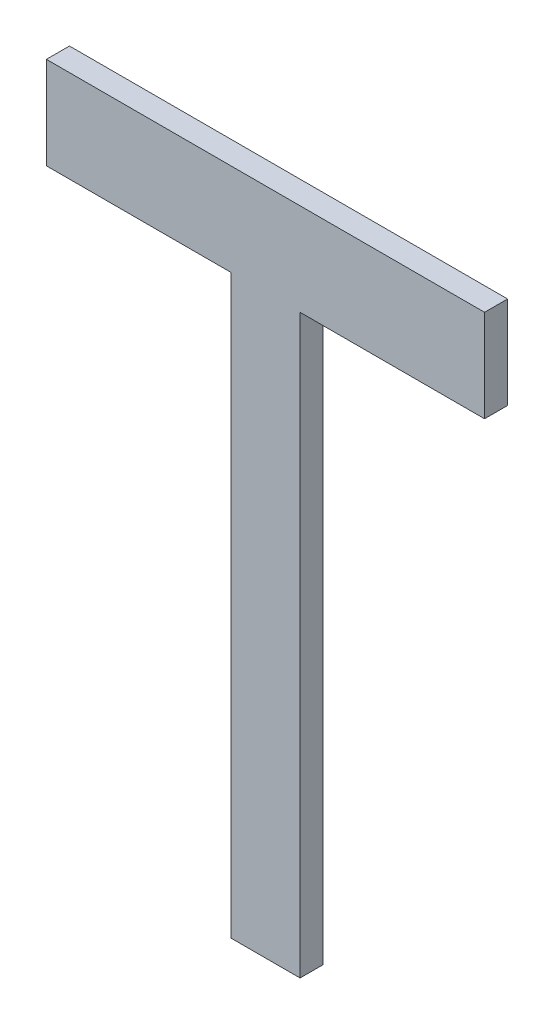
ISO-10303-21;
HEADER;
FILE_DESCRIPTION(('STEP AP214'),'2;1');
FILE_NAME('part.step','',(''),(''),'','','');
FILE_SCHEMA(('AUTOMOTIVE_DESIGN { 1 0 10303 214 1 1 1 1 }'));
ENDSEC;
DATA;
#1=APPLICATION_CONTEXT('core data for automotive mechanical design processes');
#2=APPLICATION_PROTOCOL_DEFINITION('international standard','automotive_design',2000,#1);
#3=PRODUCT_CONTEXT('',#1,'mechanical');
#4=PRODUCT('Part','Part','',(#3));
#5=PRODUCT_RELATED_PRODUCT_CATEGORY('part','',(#4));
#6=PRODUCT_DEFINITION_FORMATION('','',#4);
#7=PRODUCT_DEFINITION_CONTEXT('part definition',#1,'design');
#8=PRODUCT_DEFINITION('design','',#6,#7);
#9=PRODUCT_DEFINITION_SHAPE('','',#8);
#10=(LENGTH_UNIT() NAMED_UNIT(*) SI_UNIT(.MILLI.,.METRE.));
#11=(NAMED_UNIT(*) PLANE_ANGLE_UNIT() SI_UNIT($,.RADIAN.));
#12=(NAMED_UNIT(*) SI_UNIT($,.STERADIAN.) SOLID_ANGLE_UNIT());
#13=UNCERTAINTY_MEASURE_WITH_UNIT(LENGTH_MEASURE(1.E-05),#10,'distance_accuracy_value','');
#14=(GEOMETRIC_REPRESENTATION_CONTEXT(3) GLOBAL_UNCERTAINTY_ASSIGNED_CONTEXT((#13)) GLOBAL_UNIT_ASSIGNED_CONTEXT((#10,
#11,#12)) REPRESENTATION_CONTEXT('',''));
#15=CARTESIAN_POINT('',(0.,0.,0.));
#16=DIRECTION('',(0.,0.,1.));
#17=DIRECTION('',(1.,0.,0.));
#18=AXIS2_PLACEMENT_3D('',#15,#16,#17);
#19=CARTESIAN_POINT('',(-0.09499854000001,0.14500098,0.01));
#20=DIRECTION('',(0.,0.,-1.));
#21=DIRECTION('',(-1.,0.,0.));
#22=AXIS2_PLACEMENT_3D('',#19,#20,#21);
#23=PLANE('',#22);
#24=DIRECTION('',(1.,0.,0.));
#25=VECTOR('',#24,1.);
#26=CARTESIAN_POINT('',(-0.09499854000001,0.10500106,0.01));
#27=LINE('',#26,#25);
#28=CARTESIAN_POINT('',(-0.09499854000001,0.10500106,0.01));
#29=VERTEX_POINT('',#28);
#30=CARTESIAN_POINT('',(-0.01499870000001,0.10500106,0.01));
#31=VERTEX_POINT('',#30);
#32=EDGE_CURVE('E115',#29,#31,#27,.T.);
#33=ORIENTED_EDGE('',*,*,#32,.T.);
#34=DIRECTION('',(0.,1.,0.));
#35=VECTOR('',#34,1.);
#36=CARTESIAN_POINT('',(-0.01499870000001,0.10500106,0.01));
#37=LINE('',#36,#35);
#38=CARTESIAN_POINT('',(-0.01499870000001,-0.14499844,0.01));
#39=VERTEX_POINT('',#38);
#40=EDGE_CURVE('E111',#31,#39,#37,.F.);
#41=ORIENTED_EDGE('',*,*,#40,.T.);
#42=DIRECTION('',(1.,0.,0.));
#43=VECTOR('',#42,1.);
#44=CARTESIAN_POINT('',(-0.01499870000001,-0.14499844,0.01));
#45=LINE('',#44,#43);
#46=CARTESIAN_POINT('',(0.01500124,-0.14499844,0.01));
#47=VERTEX_POINT('',#46);
#48=EDGE_CURVE('E107',#39,#47,#45,.T.);
#49=ORIENTED_EDGE('',*,*,#48,.T.);
#50=DIRECTION('',(0.,1.,0.));
#51=VECTOR('',#50,1.);
#52=CARTESIAN_POINT('',(0.01500124,-0.14499844,0.01));
#53=LINE('',#52,#51);
#54=CARTESIAN_POINT('',(0.01500124,0.10500106,0.01));
#55=VERTEX_POINT('',#54);
#56=EDGE_CURVE('E103',#47,#55,#53,.T.);
#57=ORIENTED_EDGE('',*,*,#56,.T.);
#58=DIRECTION('',(1.,0.,0.));
#59=VECTOR('',#58,1.);
#60=CARTESIAN_POINT('',(0.01500124,0.10500106,0.01));
#61=LINE('',#60,#59);
#62=CARTESIAN_POINT('',(0.09500108,0.10500106,0.01));
#63=VERTEX_POINT('',#62);
#64=EDGE_CURVE('E79',#55,#63,#61,.T.);
#65=ORIENTED_EDGE('',*,*,#64,.T.);
#66=DIRECTION('',(0.,1.,0.));
#67=VECTOR('',#66,1.);
#68=CARTESIAN_POINT('',(0.09500108,0.10500106,0.01));
#69=LINE('',#68,#67);
#70=CARTESIAN_POINT('',(0.09500108,0.14500098,0.01));
#71=VERTEX_POINT('',#70);
#72=EDGE_CURVE('E81',#63,#71,#69,.T.);
#73=ORIENTED_EDGE('',*,*,#72,.T.);
#74=DIRECTION('',(1.,0.,0.));
#75=VECTOR('',#74,1.);
#76=CARTESIAN_POINT('',(0.09500108,0.14500098,0.01));
#77=LINE('',#76,#75);
#78=CARTESIAN_POINT('',(-0.09499854000001,0.14500098,0.01));
#79=VERTEX_POINT('',#78);
#80=EDGE_CURVE('E19',#71,#79,#77,.F.);
#81=ORIENTED_EDGE('',*,*,#80,.T.);
#82=DIRECTION('',(0.,1.,0.));
#83=VECTOR('',#82,1.);
#84=CARTESIAN_POINT('',(-0.09499854000001,0.14500098,0.01));
#85=LINE('',#84,#83);
#86=EDGE_CURVE('E120',#79,#29,#85,.F.);
#87=ORIENTED_EDGE('',*,*,#86,.T.);
#88=EDGE_LOOP('',(#33,#41,#49,#57,#65,#73,#81,#87));
#89=FACE_BOUND('',#88,.T.);
#90=ADVANCED_FACE('F16',(#89),#23,.F.);
#91=CARTESIAN_POINT('',(0.09500108,0.14500098,0.));
#92=DIRECTION('',(0.,-1.,0.));
#93=DIRECTION('',(0.,0.,-1.));
#94=AXIS2_PLACEMENT_3D('',#91,#92,#93);
#95=PLANE('',#94);
#96=DIRECTION('',(0.,0.,-1.));
#97=VECTOR('',#96,1.);
#98=CARTESIAN_POINT('',(-0.09499854000001,0.14500098,0.));
#99=LINE('',#98,#97);
#100=CARTESIAN_POINT('',(-0.09499854000001,0.14500098,0.));
#101=VERTEX_POINT('',#100);
#102=EDGE_CURVE('E92',#101,#79,#99,.F.);
#103=ORIENTED_EDGE('',*,*,#102,.T.);
#104=ORIENTED_EDGE('',*,*,#80,.F.);
#105=DIRECTION('',(0.,0.,1.));
#106=VECTOR('',#105,1.);
#107=CARTESIAN_POINT('',(0.09500108,0.14500098,0.));
#108=LINE('',#107,#106);
#109=CARTESIAN_POINT('',(0.09500108,0.14500098,0.));
#110=VERTEX_POINT('',#109);
#111=EDGE_CURVE('E87',#71,#110,#108,.F.);
#112=ORIENTED_EDGE('',*,*,#111,.T.);
#113=DIRECTION('',(-1.,0.,0.));
#114=VECTOR('',#113,1.);
#115=CARTESIAN_POINT('',(-0.09499854000001,0.14500098,0.));
#116=LINE('',#115,#114);
#117=EDGE_CURVE('E123',#101,#110,#116,.F.);
#118=ORIENTED_EDGE('',*,*,#117,.F.);
#119=EDGE_LOOP('',(#103,#104,#112,#118));
#120=FACE_BOUND('',#119,.T.);
#121=ADVANCED_FACE('F89',(#120),#95,.F.);
#122=CARTESIAN_POINT('',(0.09500108,0.10500106,0.));
#123=DIRECTION('',(-1.,0.,0.));
#124=DIRECTION('',(0.,0.,1.));
#125=AXIS2_PLACEMENT_3D('',#122,#123,#124);
#126=PLANE('',#125);
#127=ORIENTED_EDGE('',*,*,#111,.F.);
#128=ORIENTED_EDGE('',*,*,#72,.F.);
#129=DIRECTION('',(0.,0.,1.));
#130=VECTOR('',#129,1.);
#131=CARTESIAN_POINT('',(0.09500108,0.10500106,0.));
#132=LINE('',#131,#130);
#133=CARTESIAN_POINT('',(0.09500108,0.10500106,0.));
#134=VERTEX_POINT('',#133);
#135=EDGE_CURVE('E99',#63,#134,#132,.F.);
#136=ORIENTED_EDGE('',*,*,#135,.T.);
#137=DIRECTION('',(0.,1.,0.));
#138=VECTOR('',#137,1.);
#139=CARTESIAN_POINT('',(0.09500108,0.14500098,0.));
#140=LINE('',#139,#138);
#141=EDGE_CURVE('E96',#110,#134,#140,.F.);
#142=ORIENTED_EDGE('',*,*,#141,.F.);
#143=EDGE_LOOP('',(#127,#128,#136,#142));
#144=FACE_BOUND('',#143,.T.);
#145=ADVANCED_FACE('F94',(#144),#126,.F.);
#146=CARTESIAN_POINT('',(0.01500124,0.10500106,0.));
#147=DIRECTION('',(0.,1.,0.));
#148=DIRECTION('',(0.,0.,1.));
#149=AXIS2_PLACEMENT_3D('',#146,#147,#148);
#150=PLANE('',#149);
#151=ORIENTED_EDGE('',*,*,#135,.F.);
#152=ORIENTED_EDGE('',*,*,#64,.F.);
#153=DIRECTION('',(0.,0.,1.));
#154=VECTOR('',#153,1.);
#155=CARTESIAN_POINT('',(0.01500124,0.10500106,0.));
#156=LINE('',#155,#154);
#157=CARTESIAN_POINT('',(0.01500124,0.10500106,0.));
#158=VERTEX_POINT('',#157);
#159=EDGE_CURVE('E105',#55,#158,#156,.F.);
#160=ORIENTED_EDGE('',*,*,#159,.T.);
#161=DIRECTION('',(-1.,0.,0.));
#162=VECTOR('',#161,1.);
#163=CARTESIAN_POINT('',(-0.09499854000001,0.10500106,0.));
#164=LINE('',#163,#162);
#165=EDGE_CURVE('E126',#134,#158,#164,.T.);
#166=ORIENTED_EDGE('',*,*,#165,.F.);
#167=EDGE_LOOP('',(#151,#152,#160,#166));
#168=FACE_BOUND('',#167,.T.);
#169=ADVANCED_FACE('F159',(#168),#150,.F.);
#170=CARTESIAN_POINT('',(0.01500124,-0.14499844,0.));
#171=DIRECTION('',(-1.,0.,0.));
#172=DIRECTION('',(0.,0.,1.));
#173=AXIS2_PLACEMENT_3D('',#170,#171,#172);
#174=PLANE('',#173);
#175=ORIENTED_EDGE('',*,*,#159,.F.);
#176=ORIENTED_EDGE('',*,*,#56,.F.);
#177=DIRECTION('',(0.,0.,1.));
#178=VECTOR('',#177,1.);
#179=CARTESIAN_POINT('',(0.01500124,-0.14499844,0.));
#180=LINE('',#179,#178);
#181=CARTESIAN_POINT('',(0.01500124,-0.14499844,0.));
#182=VERTEX_POINT('',#181);
#183=EDGE_CURVE('E109',#47,#182,#180,.F.);
#184=ORIENTED_EDGE('',*,*,#183,.T.);
#185=DIRECTION('',(0.,1.,0.));
#186=VECTOR('',#185,1.);
#187=CARTESIAN_POINT('',(0.01500124,0.14500098,0.));
#188=LINE('',#187,#186);
#189=EDGE_CURVE('E129',#158,#182,#188,.F.);
#190=ORIENTED_EDGE('',*,*,#189,.F.);
#191=EDGE_LOOP('',(#175,#176,#184,#190));
#192=FACE_BOUND('',#191,.T.);
#193=ADVANCED_FACE('F157',(#192),#174,.F.);
#194=CARTESIAN_POINT('',(-0.01499870000001,-0.14499844,0.));
#195=DIRECTION('',(0.,1.,0.));
#196=DIRECTION('',(0.,0.,1.));
#197=AXIS2_PLACEMENT_3D('',#194,#195,#196);
#198=PLANE('',#197);
#199=ORIENTED_EDGE('',*,*,#183,.F.);
#200=ORIENTED_EDGE('',*,*,#48,.F.);
#201=DIRECTION('',(0.,0.,-1.));
#202=VECTOR('',#201,1.);
#203=CARTESIAN_POINT('',(-0.01499870000001,-0.14499844,0.));
#204=LINE('',#203,#202);
#205=CARTESIAN_POINT('',(-0.01499870000001,-0.14499844,0.));
#206=VERTEX_POINT('',#205);
#207=EDGE_CURVE('E113',#39,#206,#204,.T.);
#208=ORIENTED_EDGE('',*,*,#207,.T.);
#209=DIRECTION('',(-1.,0.,0.));
#210=VECTOR('',#209,1.);
#211=CARTESIAN_POINT('',(-0.09499854000001,-0.14499844,0.));
#212=LINE('',#211,#210);
#213=EDGE_CURVE('E132',#182,#206,#212,.T.);
#214=ORIENTED_EDGE('',*,*,#213,.F.);
#215=EDGE_LOOP('',(#199,#200,#208,#214));
#216=FACE_BOUND('',#215,.T.);
#217=ADVANCED_FACE('F152',(#216),#198,.F.);
#218=CARTESIAN_POINT('',(-0.01499870000001,0.10500106,0.));
#219=DIRECTION('',(1.,0.,0.));
#220=DIRECTION('',(0.,0.,-1.));
#221=AXIS2_PLACEMENT_3D('',#218,#219,#220);
#222=PLANE('',#221);
#223=ORIENTED_EDGE('',*,*,#207,.F.);
#224=ORIENTED_EDGE('',*,*,#40,.F.);
#225=DIRECTION('',(0.,0.,1.));
#226=VECTOR('',#225,1.);
#227=CARTESIAN_POINT('',(-0.01499870000001,0.10500106,0.));
#228=LINE('',#227,#226);
#229=CARTESIAN_POINT('',(-0.01499870000001,0.10500106,0.));
#230=VERTEX_POINT('',#229);
#231=EDGE_CURVE('E117',#31,#230,#228,.F.);
#232=ORIENTED_EDGE('',*,*,#231,.T.);
#233=DIRECTION('',(0.,1.,0.));
#234=VECTOR('',#233,1.);
#235=CARTESIAN_POINT('',(-0.01499870000001,0.14500098,0.));
#236=LINE('',#235,#234);
#237=EDGE_CURVE('E135',#206,#230,#236,.T.);
#238=ORIENTED_EDGE('',*,*,#237,.F.);
#239=EDGE_LOOP('',(#223,#224,#232,#238));
#240=FACE_BOUND('',#239,.T.);
#241=ADVANCED_FACE('F147',(#240),#222,.F.);
#242=CARTESIAN_POINT('',(-0.09499854000001,0.10500106,0.));
#243=DIRECTION('',(0.,1.,0.));
#244=DIRECTION('',(0.,0.,1.));
#245=AXIS2_PLACEMENT_3D('',#242,#243,#244);
#246=PLANE('',#245);
#247=ORIENTED_EDGE('',*,*,#231,.F.);
#248=ORIENTED_EDGE('',*,*,#32,.F.);
#249=DIRECTION('',(0.,0.,-1.));
#250=VECTOR('',#249,1.);
#251=CARTESIAN_POINT('',(-0.09499854000001,0.10500106,0.));
#252=LINE('',#251,#250);
#253=CARTESIAN_POINT('',(-0.09499854000001,0.10500106,0.));
#254=VERTEX_POINT('',#253);
#255=EDGE_CURVE('E34',#29,#254,#252,.T.);
#256=ORIENTED_EDGE('',*,*,#255,.T.);
#257=DIRECTION('',(-1.,0.,0.));
#258=VECTOR('',#257,1.);
#259=CARTESIAN_POINT('',(-0.09499854000001,0.10500106,0.));
#260=LINE('',#259,#258);
#261=EDGE_CURVE('E25',#230,#254,#260,.T.);
#262=ORIENTED_EDGE('',*,*,#261,.F.);
#263=EDGE_LOOP('',(#247,#248,#256,#262));
#264=FACE_BOUND('',#263,.T.);
#265=ADVANCED_FACE('F143',(#264),#246,.F.);
#266=CARTESIAN_POINT('',(-0.09499854000001,0.14500098,0.));
#267=DIRECTION('',(1.,0.,0.));
#268=DIRECTION('',(0.,0.,-1.));
#269=AXIS2_PLACEMENT_3D('',#266,#267,#268);
#270=PLANE('',#269);
#271=ORIENTED_EDGE('',*,*,#255,.F.);
#272=ORIENTED_EDGE('',*,*,#86,.F.);
#273=ORIENTED_EDGE('',*,*,#102,.F.);
#274=DIRECTION('',(0.,1.,0.));
#275=VECTOR('',#274,1.);
#276=CARTESIAN_POINT('',(-0.09499854000001,0.14500098,0.));
#277=LINE('',#276,#275);
#278=EDGE_CURVE('E11',#254,#101,#277,.T.);
#279=ORIENTED_EDGE('',*,*,#278,.F.);
#280=EDGE_LOOP('',(#271,#272,#273,#279));
#281=FACE_BOUND('',#280,.T.);
#282=ADVANCED_FACE('F162',(#281),#270,.F.);
#283=CARTESIAN_POINT('',(-0.09499854000001,0.14500098,0.));
#284=DIRECTION('',(0.,0.,-1.));
#285=DIRECTION('',(-1.,0.,0.));
#286=AXIS2_PLACEMENT_3D('',#283,#284,#285);
#287=PLANE('',#286);
#288=ORIENTED_EDGE('',*,*,#261,.T.);
#289=ORIENTED_EDGE('',*,*,#278,.T.);
#290=ORIENTED_EDGE('',*,*,#117,.T.);
#291=ORIENTED_EDGE('',*,*,#141,.T.);
#292=ORIENTED_EDGE('',*,*,#165,.T.);
#293=ORIENTED_EDGE('',*,*,#189,.T.);
#294=ORIENTED_EDGE('',*,*,#213,.T.);
#295=ORIENTED_EDGE('',*,*,#237,.T.);
#296=EDGE_LOOP('',(#288,#289,#290,#291,#292,#293,#294,#295));
#297=FACE_BOUND('',#296,.T.);
#298=ADVANCED_FACE('F140',(#297),#287,.T.);
#299=CLOSED_SHELL('',(#90,#121,#145,#169,#193,#217,#241,#265,#282,#298));
#300=MANIFOLD_SOLID_BREP('B1',#299);
#301=ADVANCED_BREP_SHAPE_REPRESENTATION('',(#18,#300),#14);
#302=SHAPE_DEFINITION_REPRESENTATION(#9,#301);
ENDSEC;
END-ISO-10303-21;
